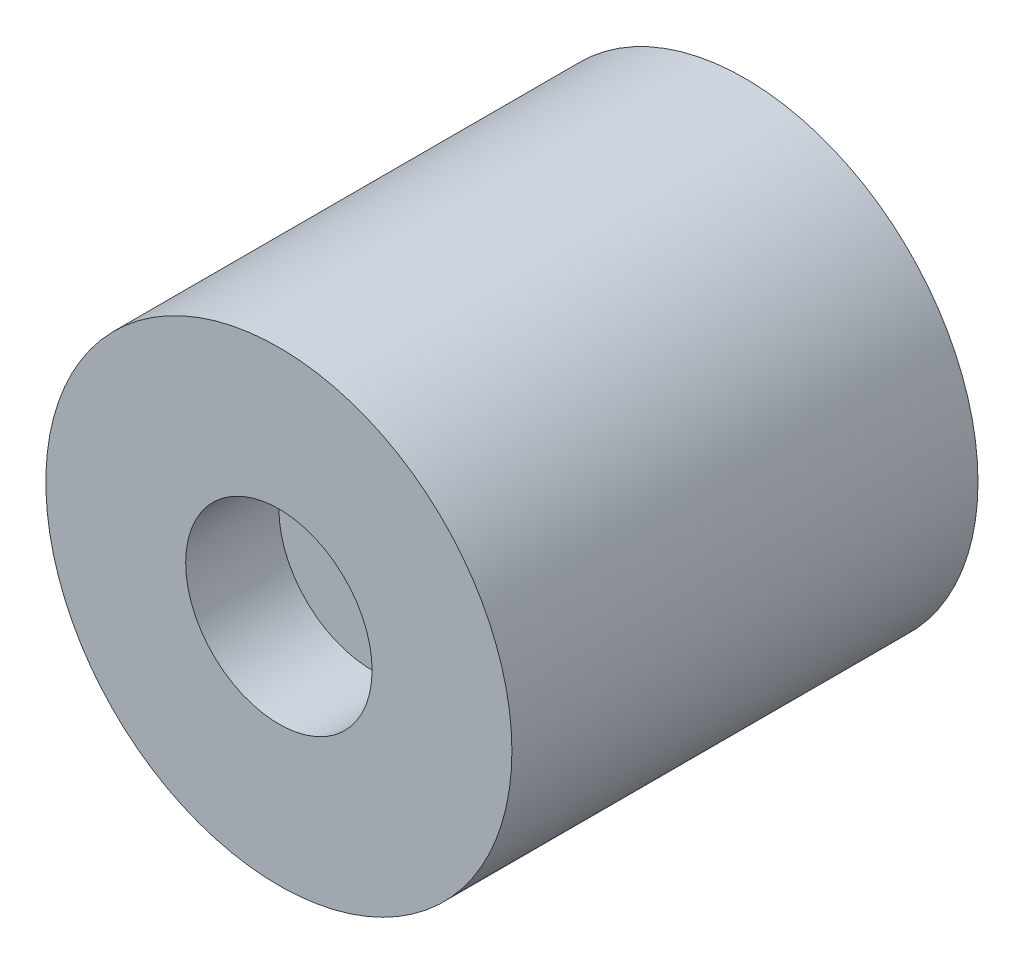
ISO-10303-21;
HEADER;
FILE_DESCRIPTION(('STEP AP214'),'2;1');
FILE_NAME('part.step','',(''),(''),'','','');
FILE_SCHEMA(('AUTOMOTIVE_DESIGN { 1 0 10303 214 1 1 1 1 }'));
ENDSEC;
DATA;
#1=APPLICATION_CONTEXT('core data for automotive mechanical design processes');
#2=APPLICATION_PROTOCOL_DEFINITION('international standard','automotive_design',2000,#1);
#3=PRODUCT_CONTEXT('',#1,'mechanical');
#4=PRODUCT('Part','Part','',(#3));
#5=PRODUCT_RELATED_PRODUCT_CATEGORY('part','',(#4));
#6=PRODUCT_DEFINITION_FORMATION('','',#4);
#7=PRODUCT_DEFINITION_CONTEXT('part definition',#1,'design');
#8=PRODUCT_DEFINITION('design','',#6,#7);
#9=PRODUCT_DEFINITION_SHAPE('','',#8);
#10=(LENGTH_UNIT() NAMED_UNIT(*) SI_UNIT(.MILLI.,.METRE.));
#11=(NAMED_UNIT(*) PLANE_ANGLE_UNIT() SI_UNIT($,.RADIAN.));
#12=(NAMED_UNIT(*) SI_UNIT($,.STERADIAN.) SOLID_ANGLE_UNIT());
#13=UNCERTAINTY_MEASURE_WITH_UNIT(LENGTH_MEASURE(1.E-05),#10,'distance_accuracy_value','');
#14=(GEOMETRIC_REPRESENTATION_CONTEXT(3) GLOBAL_UNCERTAINTY_ASSIGNED_CONTEXT((#13)) GLOBAL_UNIT_ASSIGNED_CONTEXT((#10,
#11,#12)) REPRESENTATION_CONTEXT('',''));
#15=CARTESIAN_POINT('',(0.,0.,0.));
#16=DIRECTION('',(0.,0.,1.));
#17=DIRECTION('',(1.,0.,0.));
#18=AXIS2_PLACEMENT_3D('',#15,#16,#17);
#19=CARTESIAN_POINT('',(0.,0.,25.));
#20=DIRECTION('',(0.,0.,-1.));
#21=DIRECTION('',(-1.,0.,0.));
#22=AXIS2_PLACEMENT_3D('',#19,#20,#21);
#23=CYLINDRICAL_SURFACE('',#22,12.5);
#24=CARTESIAN_POINT('',(0.,0.,25.));
#25=DIRECTION('',(0.,0.,1.));
#26=DIRECTION('',(1.,0.,0.));
#27=AXIS2_PLACEMENT_3D('',#24,#25,#26);
#28=CIRCLE('',#27,12.5);
#29=CARTESIAN_POINT('',(12.5,0.,25.));
#30=VERTEX_POINT('',#29);
#31=EDGE_CURVE('E10',#30,#30,#28,.T.);
#32=ORIENTED_EDGE('',*,*,#31,.F.);
#33=EDGE_LOOP('',(#32));
#34=FACE_BOUND('',#33,.T.);
#35=CARTESIAN_POINT('',(0.,0.,0.));
#36=DIRECTION('',(0.,0.,1.));
#37=DIRECTION('',(1.,0.,0.));
#38=AXIS2_PLACEMENT_3D('',#35,#36,#37);
#39=CIRCLE('',#38,12.5);
#40=CARTESIAN_POINT('',(12.5,0.,0.));
#41=VERTEX_POINT('',#40);
#42=EDGE_CURVE('E34',#41,#41,#39,.T.);
#43=ORIENTED_EDGE('',*,*,#42,.T.);
#44=EDGE_LOOP('',(#43));
#45=FACE_BOUND('',#44,.T.);
#46=ADVANCED_FACE('F31',(#34,#45),#23,.T.);
#47=CARTESIAN_POINT('',(0.,0.,25.));
#48=DIRECTION('',(0.,0.,1.));
#49=DIRECTION('',(1.,0.,0.));
#50=AXIS2_PLACEMENT_3D('',#47,#48,#49);
#51=PLANE('',#50);
#52=CARTESIAN_POINT('',(0.,0.,25.));
#53=DIRECTION('',(0.,0.,1.));
#54=DIRECTION('',(1.,0.,0.));
#55=AXIS2_PLACEMENT_3D('',#52,#53,#54);
#56=CIRCLE('',#55,5.);
#57=CARTESIAN_POINT('',(5.,0.,25.));
#58=VERTEX_POINT('',#57);
#59=EDGE_CURVE('E43',#58,#58,#56,.T.);
#60=ORIENTED_EDGE('',*,*,#59,.F.);
#61=EDGE_LOOP('',(#60));
#62=FACE_BOUND('',#61,.T.);
#63=ORIENTED_EDGE('',*,*,#31,.T.);
#64=EDGE_LOOP('',(#63));
#65=FACE_BOUND('',#64,.T.);
#66=ADVANCED_FACE('F58',(#62,#65),#51,.T.);
#67=CARTESIAN_POINT('',(0.,0.,0.));
#68=DIRECTION('',(0.,0.,1.));
#69=DIRECTION('',(1.,0.,0.));
#70=AXIS2_PLACEMENT_3D('',#67,#68,#69);
#71=PLANE('',#70);
#72=ORIENTED_EDGE('',*,*,#42,.F.);
#73=EDGE_LOOP('',(#72));
#74=FACE_BOUND('',#73,.T.);
#75=ADVANCED_FACE('F54',(#74),#71,.F.);
#76=CARTESIAN_POINT('',(0.,0.,20.));
#77=DIRECTION('',(0.,0.,1.));
#78=DIRECTION('',(1.,0.,0.));
#79=AXIS2_PLACEMENT_3D('',#76,#77,#78);
#80=CYLINDRICAL_SURFACE('',#79,5.);
#81=CARTESIAN_POINT('',(0.,0.,20.));
#82=DIRECTION('',(0.,0.,1.));
#83=DIRECTION('',(1.,0.,0.));
#84=AXIS2_PLACEMENT_3D('',#81,#82,#83);
#85=CIRCLE('',#84,5.);
#86=CARTESIAN_POINT('',(5.,0.,20.));
#87=VERTEX_POINT('',#86);
#88=EDGE_CURVE('E41',#87,#87,#85,.T.);
#89=ORIENTED_EDGE('',*,*,#88,.F.);
#90=EDGE_LOOP('',(#89));
#91=FACE_BOUND('',#90,.T.);
#92=ORIENTED_EDGE('',*,*,#59,.T.);
#93=EDGE_LOOP('',(#92));
#94=FACE_BOUND('',#93,.T.);
#95=ADVANCED_FACE('F51',(#91,#94),#80,.F.);
#96=CARTESIAN_POINT('',(0.,0.,20.));
#97=DIRECTION('',(0.,0.,1.));
#98=DIRECTION('',(1.,0.,0.));
#99=AXIS2_PLACEMENT_3D('',#96,#97,#98);
#100=PLANE('',#99);
#101=ORIENTED_EDGE('',*,*,#88,.T.);
#102=EDGE_LOOP('',(#101));
#103=FACE_BOUND('',#102,.T.);
#104=ADVANCED_FACE('F49',(#103),#100,.T.);
#105=CLOSED_SHELL('',(#46,#66,#75,#95,#104));
#106=MANIFOLD_SOLID_BREP('B2',#105);
#107=ADVANCED_BREP_SHAPE_REPRESENTATION('',(#18,#106),#14);
#108=SHAPE_DEFINITION_REPRESENTATION(#9,#107);
ENDSEC;
END-ISO-10303-21;
